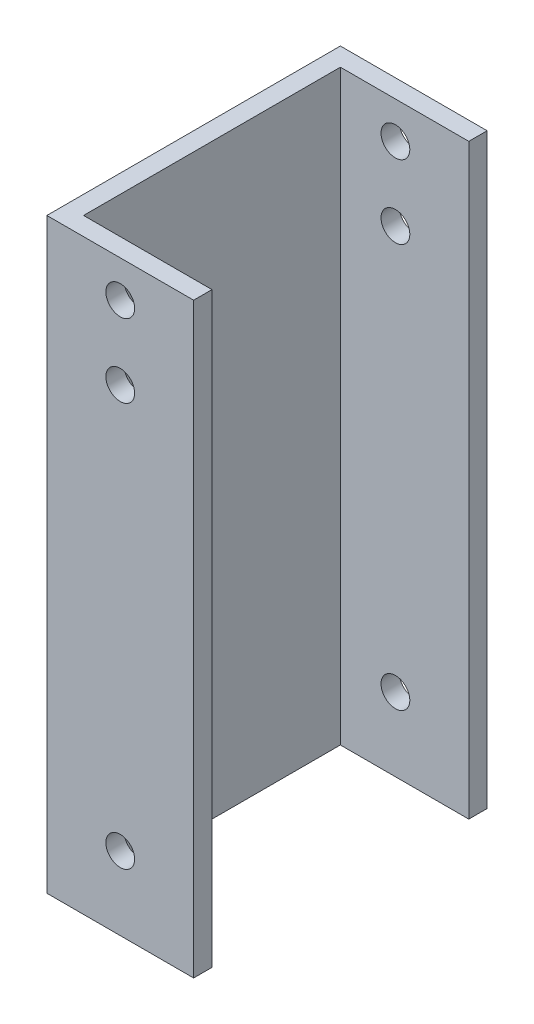
ISO-10303-21;
HEADER;
FILE_DESCRIPTION(('STEP AP214'),'2;1');
FILE_NAME('part.step','',(''),(''),'','','');
FILE_SCHEMA(('AUTOMOTIVE_DESIGN { 1 0 10303 214 1 1 1 1 }'));
ENDSEC;
DATA;
#1=APPLICATION_CONTEXT('core data for automotive mechanical design processes');
#2=APPLICATION_PROTOCOL_DEFINITION('international standard','automotive_design',2000,#1);
#3=PRODUCT_CONTEXT('',#1,'mechanical');
#4=PRODUCT('Part','Part','',(#3));
#5=PRODUCT_RELATED_PRODUCT_CATEGORY('part','',(#4));
#6=PRODUCT_DEFINITION_FORMATION('','',#4);
#7=PRODUCT_DEFINITION_CONTEXT('part definition',#1,'design');
#8=PRODUCT_DEFINITION('design','',#6,#7);
#9=PRODUCT_DEFINITION_SHAPE('','',#8);
#10=(LENGTH_UNIT() NAMED_UNIT(*) SI_UNIT(.MILLI.,.METRE.));
#11=(NAMED_UNIT(*) PLANE_ANGLE_UNIT() SI_UNIT($,.RADIAN.));
#12=(NAMED_UNIT(*) SI_UNIT($,.STERADIAN.) SOLID_ANGLE_UNIT());
#13=UNCERTAINTY_MEASURE_WITH_UNIT(LENGTH_MEASURE(1.E-05),#10,'distance_accuracy_value','');
#14=(GEOMETRIC_REPRESENTATION_CONTEXT(3) GLOBAL_UNCERTAINTY_ASSIGNED_CONTEXT((#13)) GLOBAL_UNIT_ASSIGNED_CONTEXT((#10,
#11,#12)) REPRESENTATION_CONTEXT('',''));
#15=CARTESIAN_POINT('',(0.,0.,0.));
#16=DIRECTION('',(0.,0.,1.));
#17=DIRECTION('',(1.,0.,0.));
#18=AXIS2_PLACEMENT_3D('',#15,#16,#17);
#19=CARTESIAN_POINT('',(0.,101.6,-50.8));
#20=DIRECTION('',(1.,0.,0.));
#21=DIRECTION('',(0.,0.,-1.));
#22=AXIS2_PLACEMENT_3D('',#19,#20,#21);
#23=PLANE('',#22);
#24=DIRECTION('',(0.,0.,1.));
#25=VECTOR('',#24,1.);
#26=CARTESIAN_POINT('',(0.,0.,-50.8));
#27=LINE('',#26,#25);
#28=CARTESIAN_POINT('',(0.,0.,-50.8));
#29=VERTEX_POINT('',#28);
#30=CARTESIAN_POINT('',(0.,0.,0.));
#31=VERTEX_POINT('',#30);
#32=EDGE_CURVE('E130',#29,#31,#27,.T.);
#33=ORIENTED_EDGE('',*,*,#32,.T.);
#34=DIRECTION('',(0.,-1.,0.));
#35=VECTOR('',#34,1.);
#36=CARTESIAN_POINT('',(0.,101.6,0.));
#37=LINE('',#36,#35);
#38=CARTESIAN_POINT('',(0.,101.6,0.));
#39=VERTEX_POINT('',#38);
#40=EDGE_CURVE('E11',#39,#31,#37,.T.);
#41=ORIENTED_EDGE('',*,*,#40,.F.);
#42=DIRECTION('',(0.,0.,1.));
#43=VECTOR('',#42,1.);
#44=CARTESIAN_POINT('',(0.,101.6,-50.8));
#45=LINE('',#44,#43);
#46=CARTESIAN_POINT('',(0.,101.6,-50.8));
#47=VERTEX_POINT('',#46);
#48=EDGE_CURVE('E145',#47,#39,#45,.T.);
#49=ORIENTED_EDGE('',*,*,#48,.F.);
#50=DIRECTION('',(0.,-1.,0.));
#51=VECTOR('',#50,1.);
#52=CARTESIAN_POINT('',(0.,101.6,-50.8));
#53=LINE('',#52,#51);
#54=EDGE_CURVE('E126',#47,#29,#53,.T.);
#55=ORIENTED_EDGE('',*,*,#54,.T.);
#56=EDGE_LOOP('',(#33,#41,#49,#55));
#57=FACE_BOUND('',#56,.T.);
#58=ADVANCED_FACE('F34',(#57),#23,.F.);
#59=CARTESIAN_POINT('',(0.,101.6,0.));
#60=DIRECTION('',(0.,0.,-1.));
#61=DIRECTION('',(-1.,0.,0.));
#62=AXIS2_PLACEMENT_3D('',#59,#60,#61);
#63=PLANE('',#62);
#64=CARTESIAN_POINT('',(12.7,12.7,0.));
#65=DIRECTION('',(0.,0.,-1.));
#66=DIRECTION('',(-1.,0.,0.));
#67=AXIS2_PLACEMENT_3D('',#64,#65,#66);
#68=CIRCLE('',#67,2.4892);
#69=CARTESIAN_POINT('',(10.2108,12.7,0.));
#70=VERTEX_POINT('',#69);
#71=EDGE_CURVE('E195',#70,#70,#68,.T.);
#72=ORIENTED_EDGE('',*,*,#71,.T.);
#73=EDGE_LOOP('',(#72));
#74=FACE_BOUND('',#73,.T.);
#75=CARTESIAN_POINT('',(12.7,95.25,0.));
#76=DIRECTION('',(0.,0.,-1.));
#77=DIRECTION('',(-1.,0.,0.));
#78=AXIS2_PLACEMENT_3D('',#75,#76,#77);
#79=CIRCLE('',#78,2.4892);
#80=CARTESIAN_POINT('',(10.2108,95.25,0.));
#81=VERTEX_POINT('',#80);
#82=EDGE_CURVE('E205',#81,#81,#79,.T.);
#83=ORIENTED_EDGE('',*,*,#82,.T.);
#84=EDGE_LOOP('',(#83));
#85=FACE_BOUND('',#84,.T.);
#86=CARTESIAN_POINT('',(12.7,82.55,0.));
#87=DIRECTION('',(0.,0.,-1.));
#88=DIRECTION('',(-1.,0.,0.));
#89=AXIS2_PLACEMENT_3D('',#86,#87,#88);
#90=CIRCLE('',#89,2.4892);
#91=CARTESIAN_POINT('',(10.2108,82.55,0.));
#92=VERTEX_POINT('',#91);
#93=EDGE_CURVE('E199',#92,#92,#90,.T.);
#94=ORIENTED_EDGE('',*,*,#93,.T.);
#95=EDGE_LOOP('',(#94));
#96=FACE_BOUND('',#95,.T.);
#97=DIRECTION('',(1.,0.,0.));
#98=VECTOR('',#97,1.);
#99=CARTESIAN_POINT('',(0.,0.,0.));
#100=LINE('',#99,#98);
#101=CARTESIAN_POINT('',(25.4,0.,0.));
#102=VERTEX_POINT('',#101);
#103=EDGE_CURVE('E133',#31,#102,#100,.T.);
#104=ORIENTED_EDGE('',*,*,#103,.T.);
#105=DIRECTION('',(0.,-1.,0.));
#106=VECTOR('',#105,1.);
#107=CARTESIAN_POINT('',(25.4,101.6,0.));
#108=LINE('',#107,#106);
#109=CARTESIAN_POINT('',(25.4,101.6,0.));
#110=VERTEX_POINT('',#109);
#111=EDGE_CURVE('E42',#110,#102,#108,.T.);
#112=ORIENTED_EDGE('',*,*,#111,.F.);
#113=DIRECTION('',(1.,0.,0.));
#114=VECTOR('',#113,1.);
#115=CARTESIAN_POINT('',(0.,101.6,0.));
#116=LINE('',#115,#114);
#117=EDGE_CURVE('E93',#39,#110,#116,.T.);
#118=ORIENTED_EDGE('',*,*,#117,.F.);
#119=ORIENTED_EDGE('',*,*,#40,.T.);
#120=EDGE_LOOP('',(#104,#112,#118,#119));
#121=FACE_BOUND('',#120,.T.);
#122=ADVANCED_FACE('F214',(#74,#85,#96,#121),#63,.F.);
#123=CARTESIAN_POINT('',(25.4,101.6,0.));
#124=DIRECTION('',(-1.,0.,0.));
#125=DIRECTION('',(0.,0.,1.));
#126=AXIS2_PLACEMENT_3D('',#123,#124,#125);
#127=PLANE('',#126);
#128=DIRECTION('',(0.,0.,-1.));
#129=VECTOR('',#128,1.);
#130=CARTESIAN_POINT('',(25.4,0.,0.));
#131=LINE('',#130,#129);
#132=CARTESIAN_POINT('',(25.4,0.,-3.17500000000001));
#133=VERTEX_POINT('',#132);
#134=EDGE_CURVE('E136',#102,#133,#131,.T.);
#135=ORIENTED_EDGE('',*,*,#134,.T.);
#136=DIRECTION('',(0.,-1.,0.));
#137=VECTOR('',#136,1.);
#138=CARTESIAN_POINT('',(25.4,101.6,-3.17500000000001));
#139=LINE('',#138,#137);
#140=CARTESIAN_POINT('',(25.4,101.6,-3.17500000000001));
#141=VERTEX_POINT('',#140);
#142=EDGE_CURVE('E152',#141,#133,#139,.T.);
#143=ORIENTED_EDGE('',*,*,#142,.F.);
#144=DIRECTION('',(0.,0.,-1.));
#145=VECTOR('',#144,1.);
#146=CARTESIAN_POINT('',(25.4,101.6,0.));
#147=LINE('',#146,#145);
#148=EDGE_CURVE('E160',#110,#141,#147,.T.);
#149=ORIENTED_EDGE('',*,*,#148,.F.);
#150=ORIENTED_EDGE('',*,*,#111,.T.);
#151=EDGE_LOOP('',(#135,#143,#149,#150));
#152=FACE_BOUND('',#151,.T.);
#153=ADVANCED_FACE('F158',(#152),#127,.F.);
#154=CARTESIAN_POINT('',(25.4,101.6,-3.17500000000001));
#155=DIRECTION('',(0.,0.,1.));
#156=DIRECTION('',(1.,0.,0.));
#157=AXIS2_PLACEMENT_3D('',#154,#155,#156);
#158=PLANE('',#157);
#159=CARTESIAN_POINT('',(12.7,12.7,-3.17500000000001));
#160=DIRECTION('',(0.,0.,1.));
#161=DIRECTION('',(1.,0.,0.));
#162=AXIS2_PLACEMENT_3D('',#159,#160,#161);
#163=CIRCLE('',#162,2.4892);
#164=CARTESIAN_POINT('',(15.1892,12.7,-3.17500000000001));
#165=VERTEX_POINT('',#164);
#166=EDGE_CURVE('E134',#165,#165,#163,.T.);
#167=ORIENTED_EDGE('',*,*,#166,.T.);
#168=EDGE_LOOP('',(#167));
#169=FACE_BOUND('',#168,.T.);
#170=CARTESIAN_POINT('',(12.7,95.25,-3.17500000000001));
#171=DIRECTION('',(0.,0.,1.));
#172=DIRECTION('',(1.,0.,0.));
#173=AXIS2_PLACEMENT_3D('',#170,#171,#172);
#174=CIRCLE('',#173,2.4892);
#175=CARTESIAN_POINT('',(15.1892,95.25,-3.17500000000001));
#176=VERTEX_POINT('',#175);
#177=EDGE_CURVE('E183',#176,#176,#174,.T.);
#178=ORIENTED_EDGE('',*,*,#177,.T.);
#179=EDGE_LOOP('',(#178));
#180=FACE_BOUND('',#179,.T.);
#181=CARTESIAN_POINT('',(12.7,82.55,-3.17500000000001));
#182=DIRECTION('',(0.,0.,1.));
#183=DIRECTION('',(1.,0.,0.));
#184=AXIS2_PLACEMENT_3D('',#181,#182,#183);
#185=CIRCLE('',#184,2.4892);
#186=CARTESIAN_POINT('',(15.1892,82.55,-3.17500000000001));
#187=VERTEX_POINT('',#186);
#188=EDGE_CURVE('E189',#187,#187,#185,.T.);
#189=ORIENTED_EDGE('',*,*,#188,.T.);
#190=EDGE_LOOP('',(#189));
#191=FACE_BOUND('',#190,.T.);
#192=DIRECTION('',(-1.,0.,0.));
#193=VECTOR('',#192,1.);
#194=CARTESIAN_POINT('',(25.4,0.,-3.17500000000001));
#195=LINE('',#194,#193);
#196=CARTESIAN_POINT('',(3.175,0.,-3.17500000000001));
#197=VERTEX_POINT('',#196);
#198=EDGE_CURVE('E138',#133,#197,#195,.T.);
#199=ORIENTED_EDGE('',*,*,#198,.T.);
#200=DIRECTION('',(0.,-1.,0.));
#201=VECTOR('',#200,1.);
#202=CARTESIAN_POINT('',(3.175,101.6,-3.17500000000001));
#203=LINE('',#202,#201);
#204=CARTESIAN_POINT('',(3.175,101.6,-3.17500000000001));
#205=VERTEX_POINT('',#204);
#206=EDGE_CURVE('E149',#205,#197,#203,.T.);
#207=ORIENTED_EDGE('',*,*,#206,.F.);
#208=DIRECTION('',(-1.,0.,0.));
#209=VECTOR('',#208,1.);
#210=CARTESIAN_POINT('',(25.4,101.6,-3.17500000000001));
#211=LINE('',#210,#209);
#212=EDGE_CURVE('E172',#141,#205,#211,.T.);
#213=ORIENTED_EDGE('',*,*,#212,.F.);
#214=ORIENTED_EDGE('',*,*,#142,.T.);
#215=EDGE_LOOP('',(#199,#207,#213,#214));
#216=FACE_BOUND('',#215,.T.);
#217=ADVANCED_FACE('F168',(#169,#180,#191,#216),#158,.F.);
#218=CARTESIAN_POINT('',(3.175,101.6,-3.17500000000001));
#219=DIRECTION('',(-1.,0.,0.));
#220=DIRECTION('',(0.,0.,1.));
#221=AXIS2_PLACEMENT_3D('',#218,#219,#220);
#222=PLANE('',#221);
#223=DIRECTION('',(0.,0.,-1.));
#224=VECTOR('',#223,1.);
#225=CARTESIAN_POINT('',(3.175,0.,-3.17500000000001));
#226=LINE('',#225,#224);
#227=CARTESIAN_POINT('',(3.175,0.,-47.625));
#228=VERTEX_POINT('',#227);
#229=EDGE_CURVE('E140',#197,#228,#226,.T.);
#230=ORIENTED_EDGE('',*,*,#229,.T.);
#231=DIRECTION('',(0.,-1.,0.));
#232=VECTOR('',#231,1.);
#233=CARTESIAN_POINT('',(3.175,101.6,-47.625));
#234=LINE('',#233,#232);
#235=CARTESIAN_POINT('',(3.175,101.6,-47.625));
#236=VERTEX_POINT('',#235);
#237=EDGE_CURVE('E121',#236,#228,#234,.T.);
#238=ORIENTED_EDGE('',*,*,#237,.F.);
#239=DIRECTION('',(0.,0.,-1.));
#240=VECTOR('',#239,1.);
#241=CARTESIAN_POINT('',(3.175,101.6,-3.17500000000001));
#242=LINE('',#241,#240);
#243=EDGE_CURVE('E112',#205,#236,#242,.T.);
#244=ORIENTED_EDGE('',*,*,#243,.F.);
#245=ORIENTED_EDGE('',*,*,#206,.T.);
#246=EDGE_LOOP('',(#230,#238,#244,#245));
#247=FACE_BOUND('',#246,.T.);
#248=ADVANCED_FACE('F171',(#247),#222,.F.);
#249=CARTESIAN_POINT('',(3.175,101.6,-47.625));
#250=DIRECTION('',(0.,0.,-1.));
#251=DIRECTION('',(-1.,0.,0.));
#252=AXIS2_PLACEMENT_3D('',#249,#250,#251);
#253=PLANE('',#252);
#254=CARTESIAN_POINT('',(12.7,12.7,-47.625));
#255=DIRECTION('',(0.,0.,-1.));
#256=DIRECTION('',(-1.,0.,0.));
#257=AXIS2_PLACEMENT_3D('',#254,#255,#256);
#258=CIRCLE('',#257,2.4892);
#259=CARTESIAN_POINT('',(10.2108,12.7,-47.625));
#260=VERTEX_POINT('',#259);
#261=EDGE_CURVE('E180',#260,#260,#258,.T.);
#262=ORIENTED_EDGE('',*,*,#261,.T.);
#263=EDGE_LOOP('',(#262));
#264=FACE_BOUND('',#263,.T.);
#265=CARTESIAN_POINT('',(12.7,95.25,-47.625));
#266=DIRECTION('',(0.,0.,-1.));
#267=DIRECTION('',(-1.,0.,0.));
#268=AXIS2_PLACEMENT_3D('',#265,#266,#267);
#269=CIRCLE('',#268,2.4892);
#270=CARTESIAN_POINT('',(10.2108,95.25,-47.625));
#271=VERTEX_POINT('',#270);
#272=EDGE_CURVE('E186',#271,#271,#269,.T.);
#273=ORIENTED_EDGE('',*,*,#272,.T.);
#274=EDGE_LOOP('',(#273));
#275=FACE_BOUND('',#274,.T.);
#276=CARTESIAN_POINT('',(12.7,82.55,-47.625));
#277=DIRECTION('',(0.,0.,-1.));
#278=DIRECTION('',(-1.,0.,0.));
#279=AXIS2_PLACEMENT_3D('',#276,#277,#278);
#280=CIRCLE('',#279,2.4892);
#281=CARTESIAN_POINT('',(10.2108,82.55,-47.625));
#282=VERTEX_POINT('',#281);
#283=EDGE_CURVE('E192',#282,#282,#280,.T.);
#284=ORIENTED_EDGE('',*,*,#283,.T.);
#285=EDGE_LOOP('',(#284));
#286=FACE_BOUND('',#285,.T.);
#287=DIRECTION('',(1.,0.,0.));
#288=VECTOR('',#287,1.);
#289=CARTESIAN_POINT('',(3.175,0.,-47.625));
#290=LINE('',#289,#288);
#291=CARTESIAN_POINT('',(25.4,0.,-47.625));
#292=VERTEX_POINT('',#291);
#293=EDGE_CURVE('E120',#228,#292,#290,.T.);
#294=ORIENTED_EDGE('',*,*,#293,.T.);
#295=DIRECTION('',(0.,-1.,0.));
#296=VECTOR('',#295,1.);
#297=CARTESIAN_POINT('',(25.4,101.6,-47.625));
#298=LINE('',#297,#296);
#299=CARTESIAN_POINT('',(25.4,101.6,-47.625));
#300=VERTEX_POINT('',#299);
#301=EDGE_CURVE('E117',#300,#292,#298,.T.);
#302=ORIENTED_EDGE('',*,*,#301,.F.);
#303=DIRECTION('',(1.,0.,0.));
#304=VECTOR('',#303,1.);
#305=CARTESIAN_POINT('',(3.175,101.6,-47.625));
#306=LINE('',#305,#304);
#307=EDGE_CURVE('E106',#236,#300,#306,.T.);
#308=ORIENTED_EDGE('',*,*,#307,.F.);
#309=ORIENTED_EDGE('',*,*,#237,.T.);
#310=EDGE_LOOP('',(#294,#302,#308,#309));
#311=FACE_BOUND('',#310,.T.);
#312=ADVANCED_FACE('F118',(#264,#275,#286,#311),#253,.F.);
#313=CARTESIAN_POINT('',(25.4,101.6,-47.625));
#314=DIRECTION('',(-1.,0.,0.));
#315=DIRECTION('',(0.,0.,1.));
#316=AXIS2_PLACEMENT_3D('',#313,#314,#315);
#317=PLANE('',#316);
#318=DIRECTION('',(0.,0.,-1.));
#319=VECTOR('',#318,1.);
#320=CARTESIAN_POINT('',(25.4,0.,-47.625));
#321=LINE('',#320,#319);
#322=CARTESIAN_POINT('',(25.4,0.,-50.8));
#323=VERTEX_POINT('',#322);
#324=EDGE_CURVE('E79',#292,#323,#321,.T.);
#325=ORIENTED_EDGE('',*,*,#324,.T.);
#326=DIRECTION('',(0.,-1.,0.));
#327=VECTOR('',#326,1.);
#328=CARTESIAN_POINT('',(25.4,101.6,-50.8));
#329=LINE('',#328,#327);
#330=CARTESIAN_POINT('',(25.4,101.6,-50.8));
#331=VERTEX_POINT('',#330);
#332=EDGE_CURVE('E122',#331,#323,#329,.T.);
#333=ORIENTED_EDGE('',*,*,#332,.F.);
#334=DIRECTION('',(0.,0.,-1.));
#335=VECTOR('',#334,1.);
#336=CARTESIAN_POINT('',(25.4,101.6,-47.625));
#337=LINE('',#336,#335);
#338=EDGE_CURVE('E110',#300,#331,#337,.T.);
#339=ORIENTED_EDGE('',*,*,#338,.F.);
#340=ORIENTED_EDGE('',*,*,#301,.T.);
#341=EDGE_LOOP('',(#325,#333,#339,#340));
#342=FACE_BOUND('',#341,.T.);
#343=ADVANCED_FACE('F124',(#342),#317,.F.);
#344=CARTESIAN_POINT('',(25.4,101.6,-50.8));
#345=DIRECTION('',(0.,0.,1.));
#346=DIRECTION('',(1.,0.,0.));
#347=AXIS2_PLACEMENT_3D('',#344,#345,#346);
#348=PLANE('',#347);
#349=CARTESIAN_POINT('',(12.7,12.7,-50.8));
#350=DIRECTION('',(0.,0.,-1.));
#351=DIRECTION('',(-1.,0.,0.));
#352=AXIS2_PLACEMENT_3D('',#349,#350,#351);
#353=CIRCLE('',#352,2.4892);
#354=CARTESIAN_POINT('',(10.2108,12.7,-50.8));
#355=VERTEX_POINT('',#354);
#356=EDGE_CURVE('E208',#355,#355,#353,.T.);
#357=ORIENTED_EDGE('',*,*,#356,.F.);
#358=EDGE_LOOP('',(#357));
#359=FACE_BOUND('',#358,.T.);
#360=CARTESIAN_POINT('',(12.7,95.25,-50.8));
#361=DIRECTION('',(0.,0.,-1.));
#362=DIRECTION('',(-1.,0.,0.));
#363=AXIS2_PLACEMENT_3D('',#360,#361,#362);
#364=CIRCLE('',#363,2.4892);
#365=CARTESIAN_POINT('',(10.2108,95.25,-50.8));
#366=VERTEX_POINT('',#365);
#367=EDGE_CURVE('E202',#366,#366,#364,.T.);
#368=ORIENTED_EDGE('',*,*,#367,.F.);
#369=EDGE_LOOP('',(#368));
#370=FACE_BOUND('',#369,.T.);
#371=CARTESIAN_POINT('',(12.7,82.55,-50.8));
#372=DIRECTION('',(0.,0.,-1.));
#373=DIRECTION('',(-1.,0.,0.));
#374=AXIS2_PLACEMENT_3D('',#371,#372,#373);
#375=CIRCLE('',#374,2.4892);
#376=CARTESIAN_POINT('',(10.2108,82.55,-50.8));
#377=VERTEX_POINT('',#376);
#378=EDGE_CURVE('E196',#377,#377,#375,.T.);
#379=ORIENTED_EDGE('',*,*,#378,.F.);
#380=EDGE_LOOP('',(#379));
#381=FACE_BOUND('',#380,.T.);
#382=DIRECTION('',(-1.,0.,0.));
#383=VECTOR('',#382,1.);
#384=CARTESIAN_POINT('',(25.4,0.,-50.8));
#385=LINE('',#384,#383);
#386=EDGE_CURVE('E85',#323,#29,#385,.T.);
#387=ORIENTED_EDGE('',*,*,#386,.T.);
#388=ORIENTED_EDGE('',*,*,#54,.F.);
#389=DIRECTION('',(-1.,0.,0.));
#390=VECTOR('',#389,1.);
#391=CARTESIAN_POINT('',(25.4,101.6,-50.8));
#392=LINE('',#391,#390);
#393=EDGE_CURVE('E50',#331,#47,#392,.T.);
#394=ORIENTED_EDGE('',*,*,#393,.F.);
#395=ORIENTED_EDGE('',*,*,#332,.T.);
#396=EDGE_LOOP('',(#387,#388,#394,#395));
#397=FACE_BOUND('',#396,.T.);
#398=ADVANCED_FACE('F256',(#359,#370,#381,#397),#348,.F.);
#399=CARTESIAN_POINT('',(0.,101.6,0.));
#400=DIRECTION('',(0.,1.,0.));
#401=DIRECTION('',(0.,0.,1.));
#402=AXIS2_PLACEMENT_3D('',#399,#400,#401);
#403=PLANE('',#402);
#404=ORIENTED_EDGE('',*,*,#48,.T.);
#405=ORIENTED_EDGE('',*,*,#117,.T.);
#406=ORIENTED_EDGE('',*,*,#148,.T.);
#407=ORIENTED_EDGE('',*,*,#212,.T.);
#408=ORIENTED_EDGE('',*,*,#243,.T.);
#409=ORIENTED_EDGE('',*,*,#307,.T.);
#410=ORIENTED_EDGE('',*,*,#338,.T.);
#411=ORIENTED_EDGE('',*,*,#393,.T.);
#412=EDGE_LOOP('',(#404,#405,#406,#407,#408,#409,#410,#411));
#413=FACE_BOUND('',#412,.T.);
#414=ADVANCED_FACE('F108',(#413),#403,.T.);
#415=CARTESIAN_POINT('',(0.,0.,0.));
#416=DIRECTION('',(0.,1.,0.));
#417=DIRECTION('',(0.,0.,1.));
#418=AXIS2_PLACEMENT_3D('',#415,#416,#417);
#419=PLANE('',#418);
#420=ORIENTED_EDGE('',*,*,#32,.F.);
#421=ORIENTED_EDGE('',*,*,#386,.F.);
#422=ORIENTED_EDGE('',*,*,#324,.F.);
#423=ORIENTED_EDGE('',*,*,#293,.F.);
#424=ORIENTED_EDGE('',*,*,#229,.F.);
#425=ORIENTED_EDGE('',*,*,#198,.F.);
#426=ORIENTED_EDGE('',*,*,#134,.F.);
#427=ORIENTED_EDGE('',*,*,#103,.F.);
#428=EDGE_LOOP('',(#420,#421,#422,#423,#424,#425,#426,#427));
#429=FACE_BOUND('',#428,.T.);
#430=ADVANCED_FACE('F164',(#429),#419,.F.);
#431=CARTESIAN_POINT('',(12.7,82.55,0.));
#432=DIRECTION('',(0.,0.,-1.));
#433=DIRECTION('',(-1.,0.,0.));
#434=AXIS2_PLACEMENT_3D('',#431,#432,#433);
#435=CYLINDRICAL_SURFACE('',#434,2.4892);
#436=ORIENTED_EDGE('',*,*,#378,.T.);
#437=EDGE_LOOP('',(#436));
#438=FACE_BOUND('',#437,.T.);
#439=ORIENTED_EDGE('',*,*,#283,.F.);
#440=EDGE_LOOP('',(#439));
#441=FACE_BOUND('',#440,.T.);
#442=ADVANCED_FACE('F236',(#438,#441),#435,.F.);
#443=CARTESIAN_POINT('',(12.7,95.25,0.));
#444=DIRECTION('',(0.,0.,-1.));
#445=DIRECTION('',(-1.,0.,0.));
#446=AXIS2_PLACEMENT_3D('',#443,#444,#445);
#447=CYLINDRICAL_SURFACE('',#446,2.4892);
#448=ORIENTED_EDGE('',*,*,#367,.T.);
#449=EDGE_LOOP('',(#448));
#450=FACE_BOUND('',#449,.T.);
#451=ORIENTED_EDGE('',*,*,#272,.F.);
#452=EDGE_LOOP('',(#451));
#453=FACE_BOUND('',#452,.T.);
#454=ADVANCED_FACE('F243',(#450,#453),#447,.F.);
#455=CARTESIAN_POINT('',(12.7,12.7,0.));
#456=DIRECTION('',(0.,0.,-1.));
#457=DIRECTION('',(-1.,0.,0.));
#458=AXIS2_PLACEMENT_3D('',#455,#456,#457);
#459=CYLINDRICAL_SURFACE('',#458,2.4892);
#460=ORIENTED_EDGE('',*,*,#356,.T.);
#461=EDGE_LOOP('',(#460));
#462=FACE_BOUND('',#461,.T.);
#463=ORIENTED_EDGE('',*,*,#261,.F.);
#464=EDGE_LOOP('',(#463));
#465=FACE_BOUND('',#464,.T.);
#466=ADVANCED_FACE('F222',(#462,#465),#459,.F.);
#467=ORIENTED_EDGE('',*,*,#93,.F.);
#468=EDGE_LOOP('',(#467));
#469=FACE_BOUND('',#468,.T.);
#470=ORIENTED_EDGE('',*,*,#188,.F.);
#471=EDGE_LOOP('',(#470));
#472=FACE_BOUND('',#471,.T.);
#473=ADVANCED_FACE('F232',(#469,#472),#435,.F.);
#474=ORIENTED_EDGE('',*,*,#82,.F.);
#475=EDGE_LOOP('',(#474));
#476=FACE_BOUND('',#475,.T.);
#477=ORIENTED_EDGE('',*,*,#177,.F.);
#478=EDGE_LOOP('',(#477));
#479=FACE_BOUND('',#478,.T.);
#480=ADVANCED_FACE('F220',(#476,#479),#447,.F.);
#481=ORIENTED_EDGE('',*,*,#71,.F.);
#482=EDGE_LOOP('',(#481));
#483=FACE_BOUND('',#482,.T.);
#484=ORIENTED_EDGE('',*,*,#166,.F.);
#485=EDGE_LOOP('',(#484));
#486=FACE_BOUND('',#485,.T.);
#487=ADVANCED_FACE('F217',(#483,#486),#459,.F.);
#488=CLOSED_SHELL('',(#58,#122,#153,#217,#248,#312,#343,#398,#414,#430,#442,#454,#466,#473,#480,#487));
#489=MANIFOLD_SOLID_BREP('B2',#488);
#490=ADVANCED_BREP_SHAPE_REPRESENTATION('',(#18,#489),#14);
#491=SHAPE_DEFINITION_REPRESENTATION(#9,#490);
ENDSEC;
END-ISO-10303-21;
